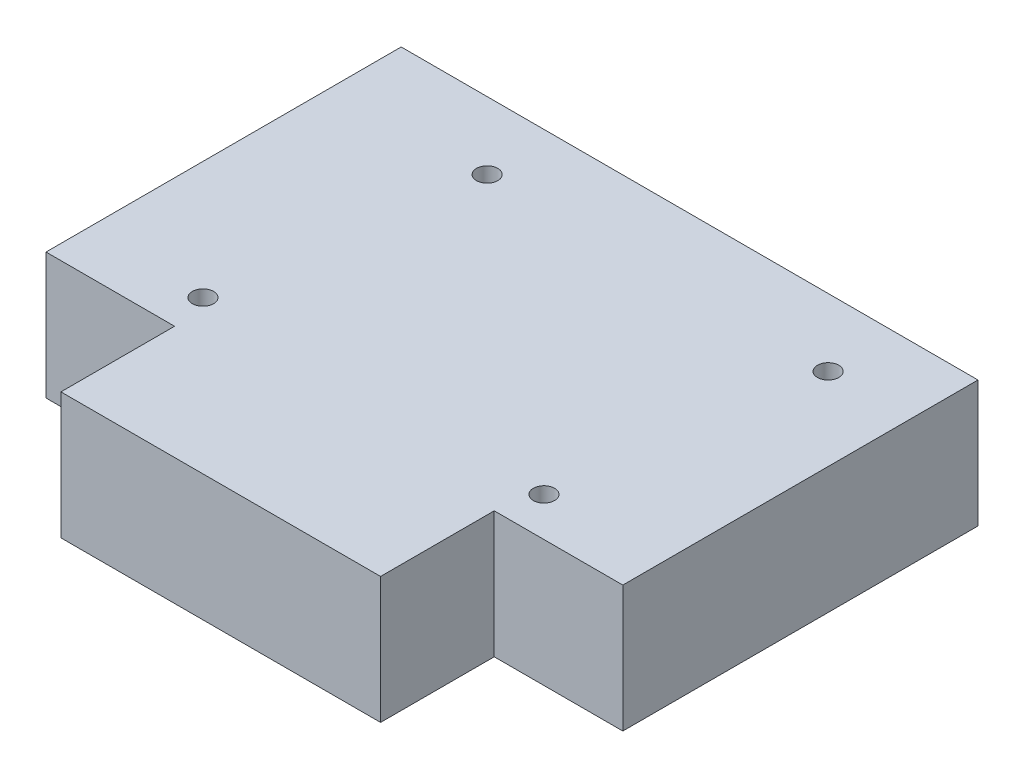
ISO-10303-21;
HEADER;
FILE_DESCRIPTION(('STEP AP214'),'2;1');
FILE_NAME('part.step','',(''),(''),'','','');
FILE_SCHEMA(('AUTOMOTIVE_DESIGN { 1 0 10303 214 1 1 1 1 }'));
ENDSEC;
DATA;
#1=APPLICATION_CONTEXT('core data for automotive mechanical design processes');
#2=APPLICATION_PROTOCOL_DEFINITION('international standard','automotive_design',2000,#1);
#3=PRODUCT_CONTEXT('',#1,'mechanical');
#4=PRODUCT('Part','Part','',(#3));
#5=PRODUCT_RELATED_PRODUCT_CATEGORY('part','',(#4));
#6=PRODUCT_DEFINITION_FORMATION('','',#4);
#7=PRODUCT_DEFINITION_CONTEXT('part definition',#1,'design');
#8=PRODUCT_DEFINITION('design','',#6,#7);
#9=PRODUCT_DEFINITION_SHAPE('','',#8);
#10=(LENGTH_UNIT() NAMED_UNIT(*) SI_UNIT(.MILLI.,.METRE.));
#11=(NAMED_UNIT(*) PLANE_ANGLE_UNIT() SI_UNIT($,.RADIAN.));
#12=(NAMED_UNIT(*) SI_UNIT($,.STERADIAN.) SOLID_ANGLE_UNIT());
#13=UNCERTAINTY_MEASURE_WITH_UNIT(LENGTH_MEASURE(1.E-05),#10,'distance_accuracy_value','');
#14=(GEOMETRIC_REPRESENTATION_CONTEXT(3) GLOBAL_UNCERTAINTY_ASSIGNED_CONTEXT((#13)) GLOBAL_UNIT_ASSIGNED_CONTEXT((#10,
#11,#12)) REPRESENTATION_CONTEXT('',''));
#15=CARTESIAN_POINT('',(0.,0.,0.));
#16=DIRECTION('',(0.,0.,1.));
#17=DIRECTION('',(1.,0.,0.));
#18=AXIS2_PLACEMENT_3D('',#15,#16,#17);
#19=CARTESIAN_POINT('',(0.,17.8,0.));
#20=DIRECTION('',(0.,-1.,0.));
#21=DIRECTION('',(0.,0.,-1.));
#22=AXIS2_PLACEMENT_3D('',#19,#20,#21);
#23=PLANE('',#22);
#24=DIRECTION('',(0.,0.,-1.));
#25=VECTOR('',#24,1.);
#26=CARTESIAN_POINT('',(40.6,17.8,25.));
#27=LINE('',#26,#25);
#28=CARTESIAN_POINT('',(40.6,17.8,25.));
#29=VERTEX_POINT('',#28);
#30=CARTESIAN_POINT('',(40.6,17.8,-25.));
#31=VERTEX_POINT('',#30);
#32=EDGE_CURVE('E148',#29,#31,#27,.T.);
#33=ORIENTED_EDGE('',*,*,#32,.T.);
#34=DIRECTION('',(-1.,0.,0.));
#35=VECTOR('',#34,1.);
#36=CARTESIAN_POINT('',(-40.6,17.8,-25.));
#37=LINE('',#36,#35);
#38=CARTESIAN_POINT('',(-40.6,17.8,-25.));
#39=VERTEX_POINT('',#38);
#40=EDGE_CURVE('E96',#31,#39,#37,.T.);
#41=ORIENTED_EDGE('',*,*,#40,.T.);
#42=DIRECTION('',(0.,0.,1.));
#43=VECTOR('',#42,1.);
#44=CARTESIAN_POINT('',(-40.6,17.8,25.));
#45=LINE('',#44,#43);
#46=CARTESIAN_POINT('',(-40.6,17.8,25.));
#47=VERTEX_POINT('',#46);
#48=EDGE_CURVE('E163',#39,#47,#45,.T.);
#49=ORIENTED_EDGE('',*,*,#48,.T.);
#50=DIRECTION('',(1.,0.,0.));
#51=VECTOR('',#50,1.);
#52=CARTESIAN_POINT('',(-40.6,17.8,25.));
#53=LINE('',#52,#51);
#54=CARTESIAN_POINT('',(-22.5,17.8,25.));
#55=VERTEX_POINT('',#54);
#56=EDGE_CURVE('E176',#47,#55,#53,.T.);
#57=ORIENTED_EDGE('',*,*,#56,.T.);
#58=DIRECTION('',(0.,0.,1.));
#59=VECTOR('',#58,1.);
#60=CARTESIAN_POINT('',(-22.5,17.8,25.));
#61=LINE('',#60,#59);
#62=CARTESIAN_POINT('',(-22.5,17.8,41.));
#63=VERTEX_POINT('',#62);
#64=EDGE_CURVE('E115',#55,#63,#61,.T.);
#65=ORIENTED_EDGE('',*,*,#64,.T.);
#66=DIRECTION('',(1.,0.,0.));
#67=VECTOR('',#66,1.);
#68=CARTESIAN_POINT('',(-22.5,17.8,41.));
#69=LINE('',#68,#67);
#70=CARTESIAN_POINT('',(22.5,17.8,41.));
#71=VERTEX_POINT('',#70);
#72=EDGE_CURVE('E109',#63,#71,#69,.T.);
#73=ORIENTED_EDGE('',*,*,#72,.T.);
#74=DIRECTION('',(0.,0.,-1.));
#75=VECTOR('',#74,1.);
#76=CARTESIAN_POINT('',(22.5,17.8,25.));
#77=LINE('',#76,#75);
#78=CARTESIAN_POINT('',(22.5,17.8,25.));
#79=VERTEX_POINT('',#78);
#80=EDGE_CURVE('E113',#71,#79,#77,.T.);
#81=ORIENTED_EDGE('',*,*,#80,.T.);
#82=DIRECTION('',(1.,0.,0.));
#83=VECTOR('',#82,1.);
#84=CARTESIAN_POINT('',(22.5,17.8,25.));
#85=LINE('',#84,#83);
#86=EDGE_CURVE('E53',#79,#29,#85,.T.);
#87=ORIENTED_EDGE('',*,*,#86,.T.);
#88=EDGE_LOOP('',(#33,#41,#49,#57,#65,#73,#81,#87));
#89=FACE_BOUND('',#88,.T.);
#90=CARTESIAN_POINT('',(-19.,17.8,-15.5));
#91=DIRECTION('',(0.,1.,0.));
#92=DIRECTION('',(0.,0.,1.));
#93=AXIS2_PLACEMENT_3D('',#90,#91,#92);
#94=CIRCLE('',#93,1.5);
#95=CARTESIAN_POINT('',(-19.,17.8,-14.));
#96=VERTEX_POINT('',#95);
#97=EDGE_CURVE('E137',#96,#96,#94,.T.);
#98=ORIENTED_EDGE('',*,*,#97,.F.);
#99=EDGE_LOOP('',(#98));
#100=FACE_BOUND('',#99,.T.);
#101=CARTESIAN_POINT('',(29.,17.8,-15.5));
#102=DIRECTION('',(0.,1.,0.));
#103=DIRECTION('',(0.,0.,1.));
#104=AXIS2_PLACEMENT_3D('',#101,#102,#103);
#105=CIRCLE('',#104,1.5);
#106=CARTESIAN_POINT('',(29.,17.8,-14.));
#107=VERTEX_POINT('',#106);
#108=EDGE_CURVE('E185',#107,#107,#105,.T.);
#109=ORIENTED_EDGE('',*,*,#108,.F.);
#110=EDGE_LOOP('',(#109));
#111=FACE_BOUND('',#110,.T.);
#112=CARTESIAN_POINT('',(-24.,17.8,19.5));
#113=DIRECTION('',(0.,1.,0.));
#114=DIRECTION('',(0.,0.,1.));
#115=AXIS2_PLACEMENT_3D('',#112,#113,#114);
#116=CIRCLE('',#115,1.5);
#117=CARTESIAN_POINT('',(-24.,17.8,21.));
#118=VERTEX_POINT('',#117);
#119=EDGE_CURVE('E191',#118,#118,#116,.T.);
#120=ORIENTED_EDGE('',*,*,#119,.F.);
#121=EDGE_LOOP('',(#120));
#122=FACE_BOUND('',#121,.T.);
#123=CARTESIAN_POINT('',(24.,17.8,19.5));
#124=DIRECTION('',(0.,1.,0.));
#125=DIRECTION('',(0.,0.,1.));
#126=AXIS2_PLACEMENT_3D('',#123,#124,#125);
#127=CIRCLE('',#126,1.5);
#128=CARTESIAN_POINT('',(24.,17.8,21.));
#129=VERTEX_POINT('',#128);
#130=EDGE_CURVE('E197',#129,#129,#127,.T.);
#131=ORIENTED_EDGE('',*,*,#130,.F.);
#132=EDGE_LOOP('',(#131));
#133=FACE_BOUND('',#132,.T.);
#134=ADVANCED_FACE('F36',(#89,#100,#111,#122,#133),#23,.F.);
#135=CARTESIAN_POINT('',(0.,0.,0.));
#136=DIRECTION('',(0.,-1.,0.));
#137=DIRECTION('',(0.,0.,-1.));
#138=AXIS2_PLACEMENT_3D('',#135,#136,#137);
#139=PLANE('',#138);
#140=CARTESIAN_POINT('',(-24.,0.,19.5));
#141=DIRECTION('',(0.,1.,0.));
#142=DIRECTION('',(0.,0.,1.));
#143=AXIS2_PLACEMENT_3D('',#140,#141,#142);
#144=CIRCLE('',#143,1.5);
#145=CARTESIAN_POINT('',(-24.,0.,21.));
#146=VERTEX_POINT('',#145);
#147=EDGE_CURVE('E194',#146,#146,#144,.T.);
#148=ORIENTED_EDGE('',*,*,#147,.T.);
#149=EDGE_LOOP('',(#148));
#150=FACE_BOUND('',#149,.T.);
#151=CARTESIAN_POINT('',(-19.,0.,-15.5));
#152=DIRECTION('',(0.,1.,0.));
#153=DIRECTION('',(0.,0.,1.));
#154=AXIS2_PLACEMENT_3D('',#151,#152,#153);
#155=CIRCLE('',#154,1.5);
#156=CARTESIAN_POINT('',(-19.,0.,-14.));
#157=VERTEX_POINT('',#156);
#158=EDGE_CURVE('E182',#157,#157,#155,.T.);
#159=ORIENTED_EDGE('',*,*,#158,.T.);
#160=EDGE_LOOP('',(#159));
#161=FACE_BOUND('',#160,.T.);
#162=DIRECTION('',(0.,0.,-1.));
#163=VECTOR('',#162,1.);
#164=CARTESIAN_POINT('',(40.6,0.,25.));
#165=LINE('',#164,#163);
#166=CARTESIAN_POINT('',(40.6,0.,25.));
#167=VERTEX_POINT('',#166);
#168=CARTESIAN_POINT('',(40.6,0.,-25.));
#169=VERTEX_POINT('',#168);
#170=EDGE_CURVE('E133',#167,#169,#165,.T.);
#171=ORIENTED_EDGE('',*,*,#170,.F.);
#172=DIRECTION('',(1.,0.,0.));
#173=VECTOR('',#172,1.);
#174=CARTESIAN_POINT('',(22.5,0.,25.));
#175=LINE('',#174,#173);
#176=CARTESIAN_POINT('',(22.5,0.,25.));
#177=VERTEX_POINT('',#176);
#178=EDGE_CURVE('E88',#177,#167,#175,.T.);
#179=ORIENTED_EDGE('',*,*,#178,.F.);
#180=DIRECTION('',(0.,0.,-1.));
#181=VECTOR('',#180,1.);
#182=CARTESIAN_POINT('',(22.5,0.,25.));
#183=LINE('',#182,#181);
#184=CARTESIAN_POINT('',(22.5,0.,41.));
#185=VERTEX_POINT('',#184);
#186=EDGE_CURVE('E82',#185,#177,#183,.T.);
#187=ORIENTED_EDGE('',*,*,#186,.F.);
#188=DIRECTION('',(1.,0.,0.));
#189=VECTOR('',#188,1.);
#190=CARTESIAN_POINT('',(-22.5,0.,41.));
#191=LINE('',#190,#189);
#192=CARTESIAN_POINT('',(-22.5,0.,41.));
#193=VERTEX_POINT('',#192);
#194=EDGE_CURVE('E123',#193,#185,#191,.T.);
#195=ORIENTED_EDGE('',*,*,#194,.F.);
#196=DIRECTION('',(0.,0.,1.));
#197=VECTOR('',#196,1.);
#198=CARTESIAN_POINT('',(-22.5,0.,25.));
#199=LINE('',#198,#197);
#200=CARTESIAN_POINT('',(-22.5,0.,25.));
#201=VERTEX_POINT('',#200);
#202=EDGE_CURVE('E143',#201,#193,#199,.T.);
#203=ORIENTED_EDGE('',*,*,#202,.F.);
#204=DIRECTION('',(1.,0.,0.));
#205=VECTOR('',#204,1.);
#206=CARTESIAN_POINT('',(-40.6,0.,25.));
#207=LINE('',#206,#205);
#208=CARTESIAN_POINT('',(-40.6,0.,25.));
#209=VERTEX_POINT('',#208);
#210=EDGE_CURVE('E141',#209,#201,#207,.T.);
#211=ORIENTED_EDGE('',*,*,#210,.F.);
#212=DIRECTION('',(0.,0.,1.));
#213=VECTOR('',#212,1.);
#214=CARTESIAN_POINT('',(-40.6,0.,25.));
#215=LINE('',#214,#213);
#216=CARTESIAN_POINT('',(-40.6,0.,-25.));
#217=VERTEX_POINT('',#216);
#218=EDGE_CURVE('E139',#217,#209,#215,.T.);
#219=ORIENTED_EDGE('',*,*,#218,.F.);
#220=DIRECTION('',(-1.,0.,0.));
#221=VECTOR('',#220,1.);
#222=CARTESIAN_POINT('',(-40.6,0.,-25.));
#223=LINE('',#222,#221);
#224=EDGE_CURVE('E136',#169,#217,#223,.T.);
#225=ORIENTED_EDGE('',*,*,#224,.F.);
#226=EDGE_LOOP('',(#171,#179,#187,#195,#203,#211,#219,#225));
#227=FACE_BOUND('',#226,.T.);
#228=CARTESIAN_POINT('',(29.,0.,-15.5));
#229=DIRECTION('',(0.,1.,0.));
#230=DIRECTION('',(0.,0.,1.));
#231=AXIS2_PLACEMENT_3D('',#228,#229,#230);
#232=CIRCLE('',#231,1.5);
#233=CARTESIAN_POINT('',(29.,0.,-14.));
#234=VERTEX_POINT('',#233);
#235=EDGE_CURVE('E188',#234,#234,#232,.T.);
#236=ORIENTED_EDGE('',*,*,#235,.T.);
#237=EDGE_LOOP('',(#236));
#238=FACE_BOUND('',#237,.T.);
#239=CARTESIAN_POINT('',(24.,0.,19.5));
#240=DIRECTION('',(0.,1.,0.));
#241=DIRECTION('',(0.,0.,1.));
#242=AXIS2_PLACEMENT_3D('',#239,#240,#241);
#243=CIRCLE('',#242,1.5);
#244=CARTESIAN_POINT('',(24.,0.,21.));
#245=VERTEX_POINT('',#244);
#246=EDGE_CURVE('E200',#245,#245,#243,.T.);
#247=ORIENTED_EDGE('',*,*,#246,.T.);
#248=EDGE_LOOP('',(#247));
#249=FACE_BOUND('',#248,.T.);
#250=ADVANCED_FACE('F167',(#150,#161,#227,#238,#249),#139,.T.);
#251=CARTESIAN_POINT('',(40.6,17.8,25.));
#252=DIRECTION('',(-1.,0.,0.));
#253=DIRECTION('',(0.,0.,1.));
#254=AXIS2_PLACEMENT_3D('',#251,#252,#253);
#255=PLANE('',#254);
#256=ORIENTED_EDGE('',*,*,#170,.T.);
#257=DIRECTION('',(0.,-1.,0.));
#258=VECTOR('',#257,1.);
#259=CARTESIAN_POINT('',(40.6,17.8,-25.));
#260=LINE('',#259,#258);
#261=EDGE_CURVE('E11',#31,#169,#260,.T.);
#262=ORIENTED_EDGE('',*,*,#261,.F.);
#263=ORIENTED_EDGE('',*,*,#32,.F.);
#264=DIRECTION('',(0.,-1.,0.));
#265=VECTOR('',#264,1.);
#266=CARTESIAN_POINT('',(40.6,17.8,25.));
#267=LINE('',#266,#265);
#268=EDGE_CURVE('E129',#29,#167,#267,.T.);
#269=ORIENTED_EDGE('',*,*,#268,.T.);
#270=EDGE_LOOP('',(#256,#262,#263,#269));
#271=FACE_BOUND('',#270,.T.);
#272=ADVANCED_FACE('F38',(#271),#255,.F.);
#273=CARTESIAN_POINT('',(-40.6,17.8,-25.));
#274=DIRECTION('',(0.,0.,1.));
#275=DIRECTION('',(1.,0.,0.));
#276=AXIS2_PLACEMENT_3D('',#273,#274,#275);
#277=PLANE('',#276);
#278=ORIENTED_EDGE('',*,*,#224,.T.);
#279=DIRECTION('',(0.,-1.,0.));
#280=VECTOR('',#279,1.);
#281=CARTESIAN_POINT('',(-40.6,17.8,-25.));
#282=LINE('',#281,#280);
#283=EDGE_CURVE('E45',#39,#217,#282,.T.);
#284=ORIENTED_EDGE('',*,*,#283,.F.);
#285=ORIENTED_EDGE('',*,*,#40,.F.);
#286=ORIENTED_EDGE('',*,*,#261,.T.);
#287=EDGE_LOOP('',(#278,#284,#285,#286));
#288=FACE_BOUND('',#287,.T.);
#289=ADVANCED_FACE('F232',(#288),#277,.F.);
#290=CARTESIAN_POINT('',(-40.6,17.8,25.));
#291=DIRECTION('',(1.,0.,0.));
#292=DIRECTION('',(0.,0.,-1.));
#293=AXIS2_PLACEMENT_3D('',#290,#291,#292);
#294=PLANE('',#293);
#295=ORIENTED_EDGE('',*,*,#218,.T.);
#296=DIRECTION('',(0.,-1.,0.));
#297=VECTOR('',#296,1.);
#298=CARTESIAN_POINT('',(-40.6,17.8,25.));
#299=LINE('',#298,#297);
#300=EDGE_CURVE('E155',#47,#209,#299,.T.);
#301=ORIENTED_EDGE('',*,*,#300,.F.);
#302=ORIENTED_EDGE('',*,*,#48,.F.);
#303=ORIENTED_EDGE('',*,*,#283,.T.);
#304=EDGE_LOOP('',(#295,#301,#302,#303));
#305=FACE_BOUND('',#304,.T.);
#306=ADVANCED_FACE('F161',(#305),#294,.F.);
#307=CARTESIAN_POINT('',(-40.6,17.8,25.));
#308=DIRECTION('',(0.,0.,-1.));
#309=DIRECTION('',(-1.,0.,0.));
#310=AXIS2_PLACEMENT_3D('',#307,#308,#309);
#311=PLANE('',#310);
#312=ORIENTED_EDGE('',*,*,#210,.T.);
#313=DIRECTION('',(0.,-1.,0.));
#314=VECTOR('',#313,1.);
#315=CARTESIAN_POINT('',(-22.5,17.8,25.));
#316=LINE('',#315,#314);
#317=EDGE_CURVE('E152',#55,#201,#316,.T.);
#318=ORIENTED_EDGE('',*,*,#317,.F.);
#319=ORIENTED_EDGE('',*,*,#56,.F.);
#320=ORIENTED_EDGE('',*,*,#300,.T.);
#321=EDGE_LOOP('',(#312,#318,#319,#320));
#322=FACE_BOUND('',#321,.T.);
#323=ADVANCED_FACE('F172',(#322),#311,.F.);
#324=CARTESIAN_POINT('',(-22.5,17.8,25.));
#325=DIRECTION('',(1.,0.,0.));
#326=DIRECTION('',(0.,0.,-1.));
#327=AXIS2_PLACEMENT_3D('',#324,#325,#326);
#328=PLANE('',#327);
#329=ORIENTED_EDGE('',*,*,#202,.T.);
#330=DIRECTION('',(0.,-1.,0.));
#331=VECTOR('',#330,1.);
#332=CARTESIAN_POINT('',(-22.5,17.8,41.));
#333=LINE('',#332,#331);
#334=EDGE_CURVE('E124',#63,#193,#333,.T.);
#335=ORIENTED_EDGE('',*,*,#334,.F.);
#336=ORIENTED_EDGE('',*,*,#64,.F.);
#337=ORIENTED_EDGE('',*,*,#317,.T.);
#338=EDGE_LOOP('',(#329,#335,#336,#337));
#339=FACE_BOUND('',#338,.T.);
#340=ADVANCED_FACE('F175',(#339),#328,.F.);
#341=CARTESIAN_POINT('',(-22.5,17.8,41.));
#342=DIRECTION('',(0.,0.,-1.));
#343=DIRECTION('',(-1.,0.,0.));
#344=AXIS2_PLACEMENT_3D('',#341,#342,#343);
#345=PLANE('',#344);
#346=ORIENTED_EDGE('',*,*,#194,.T.);
#347=DIRECTION('',(0.,-1.,0.));
#348=VECTOR('',#347,1.);
#349=CARTESIAN_POINT('',(22.5,17.8,41.));
#350=LINE('',#349,#348);
#351=EDGE_CURVE('E120',#71,#185,#350,.T.);
#352=ORIENTED_EDGE('',*,*,#351,.F.);
#353=ORIENTED_EDGE('',*,*,#72,.F.);
#354=ORIENTED_EDGE('',*,*,#334,.T.);
#355=EDGE_LOOP('',(#346,#352,#353,#354));
#356=FACE_BOUND('',#355,.T.);
#357=ADVANCED_FACE('F121',(#356),#345,.F.);
#358=CARTESIAN_POINT('',(22.5,17.8,25.));
#359=DIRECTION('',(-1.,0.,0.));
#360=DIRECTION('',(0.,0.,1.));
#361=AXIS2_PLACEMENT_3D('',#358,#359,#360);
#362=PLANE('',#361);
#363=ORIENTED_EDGE('',*,*,#186,.T.);
#364=DIRECTION('',(0.,-1.,0.));
#365=VECTOR('',#364,1.);
#366=CARTESIAN_POINT('',(22.5,17.8,25.));
#367=LINE('',#366,#365);
#368=EDGE_CURVE('E125',#79,#177,#367,.T.);
#369=ORIENTED_EDGE('',*,*,#368,.F.);
#370=ORIENTED_EDGE('',*,*,#80,.F.);
#371=ORIENTED_EDGE('',*,*,#351,.T.);
#372=EDGE_LOOP('',(#363,#369,#370,#371));
#373=FACE_BOUND('',#372,.T.);
#374=ADVANCED_FACE('F127',(#373),#362,.F.);
#375=CARTESIAN_POINT('',(22.5,17.8,25.));
#376=DIRECTION('',(0.,0.,-1.));
#377=DIRECTION('',(-1.,0.,0.));
#378=AXIS2_PLACEMENT_3D('',#375,#376,#377);
#379=PLANE('',#378);
#380=ORIENTED_EDGE('',*,*,#178,.T.);
#381=ORIENTED_EDGE('',*,*,#268,.F.);
#382=ORIENTED_EDGE('',*,*,#86,.F.);
#383=ORIENTED_EDGE('',*,*,#368,.T.);
#384=EDGE_LOOP('',(#380,#381,#382,#383));
#385=FACE_BOUND('',#384,.T.);
#386=ADVANCED_FACE('F220',(#385),#379,.F.);
#387=CARTESIAN_POINT('',(-19.,17.8,-15.5));
#388=DIRECTION('',(0.,-1.,0.));
#389=DIRECTION('',(0.,0.,-1.));
#390=AXIS2_PLACEMENT_3D('',#387,#388,#389);
#391=CYLINDRICAL_SURFACE('',#390,1.5);
#392=ORIENTED_EDGE('',*,*,#97,.T.);
#393=EDGE_LOOP('',(#392));
#394=FACE_BOUND('',#393,.T.);
#395=ORIENTED_EDGE('',*,*,#158,.F.);
#396=EDGE_LOOP('',(#395));
#397=FACE_BOUND('',#396,.T.);
#398=ADVANCED_FACE('F217',(#394,#397),#391,.F.);
#399=CARTESIAN_POINT('',(29.,17.8,-15.5));
#400=DIRECTION('',(0.,-1.,0.));
#401=DIRECTION('',(0.,0.,-1.));
#402=AXIS2_PLACEMENT_3D('',#399,#400,#401);
#403=CYLINDRICAL_SURFACE('',#402,1.5);
#404=ORIENTED_EDGE('',*,*,#108,.T.);
#405=EDGE_LOOP('',(#404));
#406=FACE_BOUND('',#405,.T.);
#407=ORIENTED_EDGE('',*,*,#235,.F.);
#408=EDGE_LOOP('',(#407));
#409=FACE_BOUND('',#408,.T.);
#410=ADVANCED_FACE('F296',(#406,#409),#403,.F.);
#411=CARTESIAN_POINT('',(-24.,17.8,19.5));
#412=DIRECTION('',(0.,-1.,0.));
#413=DIRECTION('',(0.,0.,-1.));
#414=AXIS2_PLACEMENT_3D('',#411,#412,#413);
#415=CYLINDRICAL_SURFACE('',#414,1.5);
#416=ORIENTED_EDGE('',*,*,#119,.T.);
#417=EDGE_LOOP('',(#416));
#418=FACE_BOUND('',#417,.T.);
#419=ORIENTED_EDGE('',*,*,#147,.F.);
#420=EDGE_LOOP('',(#419));
#421=FACE_BOUND('',#420,.T.);
#422=ADVANCED_FACE('F304',(#418,#421),#415,.F.);
#423=CARTESIAN_POINT('',(24.,17.8,19.5));
#424=DIRECTION('',(0.,-1.,0.));
#425=DIRECTION('',(0.,0.,-1.));
#426=AXIS2_PLACEMENT_3D('',#423,#424,#425);
#427=CYLINDRICAL_SURFACE('',#426,1.5);
#428=ORIENTED_EDGE('',*,*,#130,.T.);
#429=EDGE_LOOP('',(#428));
#430=FACE_BOUND('',#429,.T.);
#431=ORIENTED_EDGE('',*,*,#246,.F.);
#432=EDGE_LOOP('',(#431));
#433=FACE_BOUND('',#432,.T.);
#434=ADVANCED_FACE('F206',(#430,#433),#427,.F.);
#435=CLOSED_SHELL('',(#134,#250,#272,#289,#306,#323,#340,#357,#374,#386,#398,#410,#422,#434));
#436=MANIFOLD_SOLID_BREP('B2',#435);
#437=ADVANCED_BREP_SHAPE_REPRESENTATION('',(#18,#436),#14);
#438=SHAPE_DEFINITION_REPRESENTATION(#9,#437);
ENDSEC;
END-ISO-10303-21;
